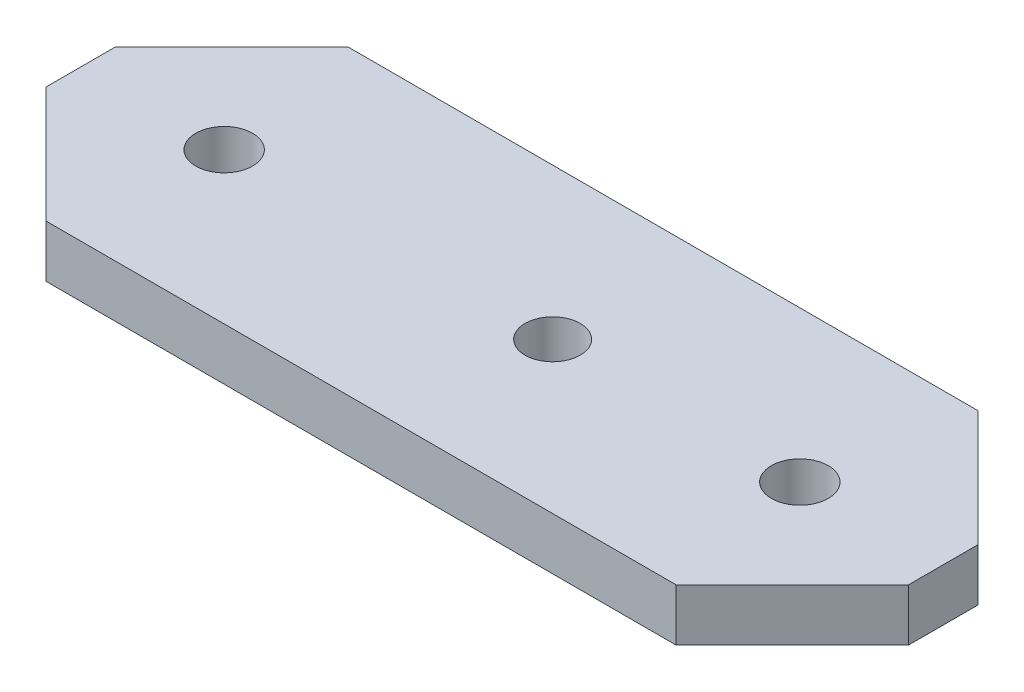
ISO-10303-21;
HEADER;
FILE_DESCRIPTION(('STEP AP214'),'2;1');
FILE_NAME('part.step','',(''),(''),'','','');
FILE_SCHEMA(('AUTOMOTIVE_DESIGN { 1 0 10303 214 1 1 1 1 }'));
ENDSEC;
DATA;
#1=APPLICATION_CONTEXT('core data for automotive mechanical design processes');
#2=APPLICATION_PROTOCOL_DEFINITION('international standard','automotive_design',2000,#1);
#3=PRODUCT_CONTEXT('',#1,'mechanical');
#4=PRODUCT('Part','Part','',(#3));
#5=PRODUCT_RELATED_PRODUCT_CATEGORY('part','',(#4));
#6=PRODUCT_DEFINITION_FORMATION('','',#4);
#7=PRODUCT_DEFINITION_CONTEXT('part definition',#1,'design');
#8=PRODUCT_DEFINITION('design','',#6,#7);
#9=PRODUCT_DEFINITION_SHAPE('','',#8);
#10=(LENGTH_UNIT() NAMED_UNIT(*) SI_UNIT(.MILLI.,.METRE.));
#11=(NAMED_UNIT(*) PLANE_ANGLE_UNIT() SI_UNIT($,.RADIAN.));
#12=(NAMED_UNIT(*) SI_UNIT($,.STERADIAN.) SOLID_ANGLE_UNIT());
#13=UNCERTAINTY_MEASURE_WITH_UNIT(LENGTH_MEASURE(1.E-05),#10,'distance_accuracy_value','');
#14=(GEOMETRIC_REPRESENTATION_CONTEXT(3) GLOBAL_UNCERTAINTY_ASSIGNED_CONTEXT((#13)) GLOBAL_UNIT_ASSIGNED_CONTEXT((#10,
#11,#12)) REPRESENTATION_CONTEXT('',''));
#15=CARTESIAN_POINT('',(0.,0.,0.));
#16=DIRECTION('',(0.,0.,1.));
#17=DIRECTION('',(1.,0.,0.));
#18=AXIS2_PLACEMENT_3D('',#15,#16,#17);
#19=CARTESIAN_POINT('',(40.15,4.5,-13.));
#20=DIRECTION('',(0.,-1.,0.));
#21=DIRECTION('',(0.,0.,-1.));
#22=AXIS2_PLACEMENT_3D('',#19,#20,#21);
#23=PLANE('',#22);
#24=CARTESIAN_POINT('',(3.5,4.5,-13.));
#25=DIRECTION('',(0.,1.,0.));
#26=DIRECTION('',(0.,0.,1.));
#27=AXIS2_PLACEMENT_3D('',#24,#25,#26);
#28=CIRCLE('',#27,2.375);
#29=CARTESIAN_POINT('',(3.5,4.5,-10.625));
#30=VERTEX_POINT('',#29);
#31=EDGE_CURVE('E206',#30,#30,#28,.T.);
#32=ORIENTED_EDGE('',*,*,#31,.F.);
#33=EDGE_LOOP('',(#32));
#34=FACE_BOUND('',#33,.T.);
#35=CARTESIAN_POINT('',(24.8,4.5,-13.));
#36=DIRECTION('',(0.,1.,0.));
#37=DIRECTION('',(0.,0.,1.));
#38=AXIS2_PLACEMENT_3D('',#35,#36,#37);
#39=CIRCLE('',#38,2.45000000000001);
#40=CARTESIAN_POINT('',(24.8,4.5,-10.55));
#41=VERTEX_POINT('',#40);
#42=EDGE_CURVE('E149',#41,#41,#39,.T.);
#43=ORIENTED_EDGE('',*,*,#42,.F.);
#44=EDGE_LOOP('',(#43));
#45=FACE_BOUND('',#44,.T.);
#46=DIRECTION('',(0.707106781186548,0.,-0.707106781186547));
#47=VECTOR('',#46,1.);
#48=CARTESIAN_POINT('',(27.15,4.5,0.));
#49=LINE('',#48,#47);
#50=CARTESIAN_POINT('',(27.15,4.5,0.));
#51=VERTEX_POINT('',#50);
#52=CARTESIAN_POINT('',(37.15,4.5,-10.));
#53=VERTEX_POINT('',#52);
#54=EDGE_CURVE('E160',#51,#53,#49,.T.);
#55=ORIENTED_EDGE('',*,*,#54,.T.);
#56=DIRECTION('',(0.,0.,-1.));
#57=VECTOR('',#56,1.);
#58=CARTESIAN_POINT('',(37.15,4.5,-10.));
#59=LINE('',#58,#57);
#60=CARTESIAN_POINT('',(37.15,4.5,-16.));
#61=VERTEX_POINT('',#60);
#62=EDGE_CURVE('E108',#53,#61,#59,.T.);
#63=ORIENTED_EDGE('',*,*,#62,.T.);
#64=DIRECTION('',(-0.707106781186548,0.,-0.707106781186548));
#65=VECTOR('',#64,1.);
#66=CARTESIAN_POINT('',(27.15,4.5,-26.));
#67=LINE('',#66,#65);
#68=CARTESIAN_POINT('',(27.15,4.5,-26.));
#69=VERTEX_POINT('',#68);
#70=EDGE_CURVE('E175',#61,#69,#67,.T.);
#71=ORIENTED_EDGE('',*,*,#70,.T.);
#72=DIRECTION('',(-1.,0.,0.));
#73=VECTOR('',#72,1.);
#74=CARTESIAN_POINT('',(-27.15,4.5,-26.));
#75=LINE('',#74,#73);
#76=CARTESIAN_POINT('',(-27.15,4.5,-26.));
#77=VERTEX_POINT('',#76);
#78=EDGE_CURVE('E188',#69,#77,#75,.T.);
#79=ORIENTED_EDGE('',*,*,#78,.T.);
#80=DIRECTION('',(-0.707106781186548,0.,0.707106781186547));
#81=VECTOR('',#80,1.);
#82=CARTESIAN_POINT('',(-27.15,4.5,-26.));
#83=LINE('',#82,#81);
#84=CARTESIAN_POINT('',(-37.15,4.5,-16.));
#85=VERTEX_POINT('',#84);
#86=EDGE_CURVE('E127',#77,#85,#83,.T.);
#87=ORIENTED_EDGE('',*,*,#86,.T.);
#88=DIRECTION('',(0.,0.,1.));
#89=VECTOR('',#88,1.);
#90=CARTESIAN_POINT('',(-37.15,4.5,-10.));
#91=LINE('',#90,#89);
#92=CARTESIAN_POINT('',(-37.15,4.5,-10.));
#93=VERTEX_POINT('',#92);
#94=EDGE_CURVE('E121',#85,#93,#91,.T.);
#95=ORIENTED_EDGE('',*,*,#94,.T.);
#96=DIRECTION('',(0.707106781186548,0.,0.707106781186547));
#97=VECTOR('',#96,1.);
#98=CARTESIAN_POINT('',(-27.15,4.5,0.));
#99=LINE('',#98,#97);
#100=CARTESIAN_POINT('',(-27.15,4.5,0.));
#101=VERTEX_POINT('',#100);
#102=EDGE_CURVE('E125',#93,#101,#99,.T.);
#103=ORIENTED_EDGE('',*,*,#102,.T.);
#104=DIRECTION('',(1.,0.,0.));
#105=VECTOR('',#104,1.);
#106=CARTESIAN_POINT('',(-27.15,4.5,0.));
#107=LINE('',#106,#105);
#108=EDGE_CURVE('E65',#101,#51,#107,.T.);
#109=ORIENTED_EDGE('',*,*,#108,.T.);
#110=EDGE_LOOP('',(#55,#63,#71,#79,#87,#95,#103,#109));
#111=FACE_BOUND('',#110,.T.);
#112=CARTESIAN_POINT('',(-24.8,4.5,-13.));
#113=DIRECTION('',(0.,1.,0.));
#114=DIRECTION('',(0.,0.,-1.));
#115=AXIS2_PLACEMENT_3D('',#112,#113,#114);
#116=CIRCLE('',#115,2.45000000000001);
#117=CARTESIAN_POINT('',(-24.8,4.5,-15.45));
#118=VERTEX_POINT('',#117);
#119=EDGE_CURVE('E197',#118,#118,#116,.T.);
#120=ORIENTED_EDGE('',*,*,#119,.F.);
#121=EDGE_LOOP('',(#120));
#122=FACE_BOUND('',#121,.T.);
#123=ADVANCED_FACE('F48',(#34,#45,#111,#122),#23,.F.);
#124=CARTESIAN_POINT('',(40.15,0.,-13.));
#125=DIRECTION('',(0.,-1.,0.));
#126=DIRECTION('',(0.,0.,-1.));
#127=AXIS2_PLACEMENT_3D('',#124,#125,#126);
#128=PLANE('',#127);
#129=CARTESIAN_POINT('',(3.5,0.,-13.));
#130=DIRECTION('',(0.,1.,0.));
#131=DIRECTION('',(0.,0.,1.));
#132=AXIS2_PLACEMENT_3D('',#129,#130,#131);
#133=CIRCLE('',#132,2.375);
#134=CARTESIAN_POINT('',(3.5,0.,-10.625));
#135=VERTEX_POINT('',#134);
#136=EDGE_CURVE('E203',#135,#135,#133,.T.);
#137=ORIENTED_EDGE('',*,*,#136,.T.);
#138=EDGE_LOOP('',(#137));
#139=FACE_BOUND('',#138,.T.);
#140=CARTESIAN_POINT('',(24.8,0.,-13.));
#141=DIRECTION('',(0.,1.,0.));
#142=DIRECTION('',(0.,0.,1.));
#143=AXIS2_PLACEMENT_3D('',#140,#141,#142);
#144=CIRCLE('',#143,2.45000000000001);
#145=CARTESIAN_POINT('',(24.8,0.,-10.55));
#146=VERTEX_POINT('',#145);
#147=EDGE_CURVE('E194',#146,#146,#144,.T.);
#148=ORIENTED_EDGE('',*,*,#147,.T.);
#149=EDGE_LOOP('',(#148));
#150=FACE_BOUND('',#149,.T.);
#151=DIRECTION('',(0.707106781186548,0.,-0.707106781186547));
#152=VECTOR('',#151,1.);
#153=CARTESIAN_POINT('',(27.15,0.,0.));
#154=LINE('',#153,#152);
#155=CARTESIAN_POINT('',(27.15,0.,0.));
#156=VERTEX_POINT('',#155);
#157=CARTESIAN_POINT('',(37.15,0.,-10.));
#158=VERTEX_POINT('',#157);
#159=EDGE_CURVE('E145',#156,#158,#154,.T.);
#160=ORIENTED_EDGE('',*,*,#159,.F.);
#161=DIRECTION('',(1.,0.,0.));
#162=VECTOR('',#161,1.);
#163=CARTESIAN_POINT('',(-27.15,0.,0.));
#164=LINE('',#163,#162);
#165=CARTESIAN_POINT('',(-27.15,0.,0.));
#166=VERTEX_POINT('',#165);
#167=EDGE_CURVE('E100',#166,#156,#164,.T.);
#168=ORIENTED_EDGE('',*,*,#167,.F.);
#169=DIRECTION('',(0.707106781186548,0.,0.707106781186547));
#170=VECTOR('',#169,1.);
#171=CARTESIAN_POINT('',(-27.15,0.,0.));
#172=LINE('',#171,#170);
#173=CARTESIAN_POINT('',(-37.15,0.,-10.));
#174=VERTEX_POINT('',#173);
#175=EDGE_CURVE('E94',#174,#166,#172,.T.);
#176=ORIENTED_EDGE('',*,*,#175,.F.);
#177=DIRECTION('',(0.,0.,1.));
#178=VECTOR('',#177,1.);
#179=CARTESIAN_POINT('',(-37.15,0.,-10.));
#180=LINE('',#179,#178);
#181=CARTESIAN_POINT('',(-37.15,0.,-16.));
#182=VERTEX_POINT('',#181);
#183=EDGE_CURVE('E135',#182,#174,#180,.T.);
#184=ORIENTED_EDGE('',*,*,#183,.F.);
#185=DIRECTION('',(-0.707106781186548,0.,0.707106781186547));
#186=VECTOR('',#185,1.);
#187=CARTESIAN_POINT('',(-27.15,0.,-26.));
#188=LINE('',#187,#186);
#189=CARTESIAN_POINT('',(-27.15,0.,-26.));
#190=VERTEX_POINT('',#189);
#191=EDGE_CURVE('E155',#190,#182,#188,.T.);
#192=ORIENTED_EDGE('',*,*,#191,.F.);
#193=DIRECTION('',(-1.,0.,0.));
#194=VECTOR('',#193,1.);
#195=CARTESIAN_POINT('',(-27.15,0.,-26.));
#196=LINE('',#195,#194);
#197=CARTESIAN_POINT('',(27.15,0.,-26.));
#198=VERTEX_POINT('',#197);
#199=EDGE_CURVE('E153',#198,#190,#196,.T.);
#200=ORIENTED_EDGE('',*,*,#199,.F.);
#201=DIRECTION('',(-0.707106781186548,0.,-0.707106781186548));
#202=VECTOR('',#201,1.);
#203=CARTESIAN_POINT('',(27.15,0.,-26.));
#204=LINE('',#203,#202);
#205=CARTESIAN_POINT('',(37.15,0.,-16.));
#206=VERTEX_POINT('',#205);
#207=EDGE_CURVE('E151',#206,#198,#204,.T.);
#208=ORIENTED_EDGE('',*,*,#207,.F.);
#209=DIRECTION('',(0.,0.,-1.));
#210=VECTOR('',#209,1.);
#211=CARTESIAN_POINT('',(37.15,0.,-10.));
#212=LINE('',#211,#210);
#213=EDGE_CURVE('E148',#158,#206,#212,.T.);
#214=ORIENTED_EDGE('',*,*,#213,.F.);
#215=EDGE_LOOP('',(#160,#168,#176,#184,#192,#200,#208,#214));
#216=FACE_BOUND('',#215,.T.);
#217=CARTESIAN_POINT('',(-24.8,0.,-13.));
#218=DIRECTION('',(0.,1.,0.));
#219=DIRECTION('',(0.,0.,-1.));
#220=AXIS2_PLACEMENT_3D('',#217,#218,#219);
#221=CIRCLE('',#220,2.45000000000001);
#222=CARTESIAN_POINT('',(-24.8,0.,-15.45));
#223=VERTEX_POINT('',#222);
#224=EDGE_CURVE('E200',#223,#223,#221,.T.);
#225=ORIENTED_EDGE('',*,*,#224,.T.);
#226=EDGE_LOOP('',(#225));
#227=FACE_BOUND('',#226,.T.);
#228=ADVANCED_FACE('F179',(#139,#150,#216,#227),#128,.T.);
#229=CARTESIAN_POINT('',(27.15,4.5,0.));
#230=DIRECTION('',(-0.707106781186547,0.,-0.707106781186548));
#231=DIRECTION('',(-0.707106781186548,0.,0.707106781186547));
#232=AXIS2_PLACEMENT_3D('',#229,#230,#231);
#233=PLANE('',#232);
#234=ORIENTED_EDGE('',*,*,#159,.T.);
#235=DIRECTION('',(0.,-1.,0.));
#236=VECTOR('',#235,1.);
#237=CARTESIAN_POINT('',(37.15,4.5,-10.));
#238=LINE('',#237,#236);
#239=EDGE_CURVE('E13',#53,#158,#238,.T.);
#240=ORIENTED_EDGE('',*,*,#239,.F.);
#241=ORIENTED_EDGE('',*,*,#54,.F.);
#242=DIRECTION('',(0.,-1.,0.));
#243=VECTOR('',#242,1.);
#244=CARTESIAN_POINT('',(27.15,4.5,0.));
#245=LINE('',#244,#243);
#246=EDGE_CURVE('E141',#51,#156,#245,.T.);
#247=ORIENTED_EDGE('',*,*,#246,.T.);
#248=EDGE_LOOP('',(#234,#240,#241,#247));
#249=FACE_BOUND('',#248,.T.);
#250=ADVANCED_FACE('F50',(#249),#233,.F.);
#251=CARTESIAN_POINT('',(37.15,4.5,-10.));
#252=DIRECTION('',(-1.,0.,0.));
#253=DIRECTION('',(0.,0.,1.));
#254=AXIS2_PLACEMENT_3D('',#251,#252,#253);
#255=PLANE('',#254);
#256=ORIENTED_EDGE('',*,*,#213,.T.);
#257=DIRECTION('',(0.,-1.,0.));
#258=VECTOR('',#257,1.);
#259=CARTESIAN_POINT('',(37.15,4.5,-16.));
#260=LINE('',#259,#258);
#261=EDGE_CURVE('E57',#61,#206,#260,.T.);
#262=ORIENTED_EDGE('',*,*,#261,.F.);
#263=ORIENTED_EDGE('',*,*,#62,.F.);
#264=ORIENTED_EDGE('',*,*,#239,.T.);
#265=EDGE_LOOP('',(#256,#262,#263,#264));
#266=FACE_BOUND('',#265,.T.);
#267=ADVANCED_FACE('F237',(#266),#255,.F.);
#268=CARTESIAN_POINT('',(27.15,4.5,-26.));
#269=DIRECTION('',(-0.707106781186547,0.,0.707106781186547));
#270=DIRECTION('',(0.707106781186548,0.,0.707106781186548));
#271=AXIS2_PLACEMENT_3D('',#268,#269,#270);
#272=PLANE('',#271);
#273=ORIENTED_EDGE('',*,*,#207,.T.);
#274=DIRECTION('',(0.,-1.,0.));
#275=VECTOR('',#274,1.);
#276=CARTESIAN_POINT('',(27.15,4.5,-26.));
#277=LINE('',#276,#275);
#278=EDGE_CURVE('E167',#69,#198,#277,.T.);
#279=ORIENTED_EDGE('',*,*,#278,.F.);
#280=ORIENTED_EDGE('',*,*,#70,.F.);
#281=ORIENTED_EDGE('',*,*,#261,.T.);
#282=EDGE_LOOP('',(#273,#279,#280,#281));
#283=FACE_BOUND('',#282,.T.);
#284=ADVANCED_FACE('F173',(#283),#272,.F.);
#285=CARTESIAN_POINT('',(-27.15,4.5,-26.));
#286=DIRECTION('',(0.,0.,1.));
#287=DIRECTION('',(1.,0.,0.));
#288=AXIS2_PLACEMENT_3D('',#285,#286,#287);
#289=PLANE('',#288);
#290=ORIENTED_EDGE('',*,*,#199,.T.);
#291=DIRECTION('',(0.,-1.,0.));
#292=VECTOR('',#291,1.);
#293=CARTESIAN_POINT('',(-27.15,4.5,-26.));
#294=LINE('',#293,#292);
#295=EDGE_CURVE('E164',#77,#190,#294,.T.);
#296=ORIENTED_EDGE('',*,*,#295,.F.);
#297=ORIENTED_EDGE('',*,*,#78,.F.);
#298=ORIENTED_EDGE('',*,*,#278,.T.);
#299=EDGE_LOOP('',(#290,#296,#297,#298));
#300=FACE_BOUND('',#299,.T.);
#301=ADVANCED_FACE('F184',(#300),#289,.F.);
#302=CARTESIAN_POINT('',(-27.15,4.5,-26.));
#303=DIRECTION('',(0.707106781186547,0.,0.707106781186548));
#304=DIRECTION('',(0.707106781186548,0.,-0.707106781186547));
#305=AXIS2_PLACEMENT_3D('',#302,#303,#304);
#306=PLANE('',#305);
#307=ORIENTED_EDGE('',*,*,#191,.T.);
#308=DIRECTION('',(0.,-1.,0.));
#309=VECTOR('',#308,1.);
#310=CARTESIAN_POINT('',(-37.15,4.5,-16.));
#311=LINE('',#310,#309);
#312=EDGE_CURVE('E136',#85,#182,#311,.T.);
#313=ORIENTED_EDGE('',*,*,#312,.F.);
#314=ORIENTED_EDGE('',*,*,#86,.F.);
#315=ORIENTED_EDGE('',*,*,#295,.T.);
#316=EDGE_LOOP('',(#307,#313,#314,#315));
#317=FACE_BOUND('',#316,.T.);
#318=ADVANCED_FACE('F187',(#317),#306,.F.);
#319=CARTESIAN_POINT('',(-37.15,4.5,-10.));
#320=DIRECTION('',(1.,0.,0.));
#321=DIRECTION('',(0.,0.,-1.));
#322=AXIS2_PLACEMENT_3D('',#319,#320,#321);
#323=PLANE('',#322);
#324=ORIENTED_EDGE('',*,*,#183,.T.);
#325=DIRECTION('',(0.,-1.,0.));
#326=VECTOR('',#325,1.);
#327=CARTESIAN_POINT('',(-37.15,4.5,-10.));
#328=LINE('',#327,#326);
#329=EDGE_CURVE('E132',#93,#174,#328,.T.);
#330=ORIENTED_EDGE('',*,*,#329,.F.);
#331=ORIENTED_EDGE('',*,*,#94,.F.);
#332=ORIENTED_EDGE('',*,*,#312,.T.);
#333=EDGE_LOOP('',(#324,#330,#331,#332));
#334=FACE_BOUND('',#333,.T.);
#335=ADVANCED_FACE('F133',(#334),#323,.F.);
#336=CARTESIAN_POINT('',(-27.15,4.5,0.));
#337=DIRECTION('',(0.707106781186547,0.,-0.707106781186548));
#338=DIRECTION('',(-0.707106781186548,0.,-0.707106781186547));
#339=AXIS2_PLACEMENT_3D('',#336,#337,#338);
#340=PLANE('',#339);
#341=ORIENTED_EDGE('',*,*,#175,.T.);
#342=DIRECTION('',(0.,-1.,0.));
#343=VECTOR('',#342,1.);
#344=CARTESIAN_POINT('',(-27.15,4.5,0.));
#345=LINE('',#344,#343);
#346=EDGE_CURVE('E137',#101,#166,#345,.T.);
#347=ORIENTED_EDGE('',*,*,#346,.F.);
#348=ORIENTED_EDGE('',*,*,#102,.F.);
#349=ORIENTED_EDGE('',*,*,#329,.T.);
#350=EDGE_LOOP('',(#341,#347,#348,#349));
#351=FACE_BOUND('',#350,.T.);
#352=ADVANCED_FACE('F139',(#351),#340,.F.);
#353=CARTESIAN_POINT('',(-27.15,4.5,0.));
#354=DIRECTION('',(0.,0.,-1.));
#355=DIRECTION('',(-1.,0.,0.));
#356=AXIS2_PLACEMENT_3D('',#353,#354,#355);
#357=PLANE('',#356);
#358=ORIENTED_EDGE('',*,*,#167,.T.);
#359=ORIENTED_EDGE('',*,*,#246,.F.);
#360=ORIENTED_EDGE('',*,*,#108,.F.);
#361=ORIENTED_EDGE('',*,*,#346,.T.);
#362=EDGE_LOOP('',(#358,#359,#360,#361));
#363=FACE_BOUND('',#362,.T.);
#364=ADVANCED_FACE('F229',(#363),#357,.F.);
#365=CARTESIAN_POINT('',(24.8,4.5,-13.));
#366=DIRECTION('',(0.,-1.,0.));
#367=DIRECTION('',(0.,0.,-1.));
#368=AXIS2_PLACEMENT_3D('',#365,#366,#367);
#369=CYLINDRICAL_SURFACE('',#368,2.45000000000001);
#370=ORIENTED_EDGE('',*,*,#42,.T.);
#371=EDGE_LOOP('',(#370));
#372=FACE_BOUND('',#371,.T.);
#373=ORIENTED_EDGE('',*,*,#147,.F.);
#374=EDGE_LOOP('',(#373));
#375=FACE_BOUND('',#374,.T.);
#376=ADVANCED_FACE('F226',(#372,#375),#369,.F.);
#377=CARTESIAN_POINT('',(-24.8,4.5,-13.));
#378=DIRECTION('',(0.,-1.,0.));
#379=DIRECTION('',(0.,0.,-1.));
#380=AXIS2_PLACEMENT_3D('',#377,#378,#379);
#381=CYLINDRICAL_SURFACE('',#380,2.45000000000001);
#382=ORIENTED_EDGE('',*,*,#119,.T.);
#383=EDGE_LOOP('',(#382));
#384=FACE_BOUND('',#383,.T.);
#385=ORIENTED_EDGE('',*,*,#224,.F.);
#386=EDGE_LOOP('',(#385));
#387=FACE_BOUND('',#386,.T.);
#388=ADVANCED_FACE('F217',(#384,#387),#381,.F.);
#389=CARTESIAN_POINT('',(3.5,0.,-13.));
#390=DIRECTION('',(0.,1.,0.));
#391=DIRECTION('',(0.,0.,1.));
#392=AXIS2_PLACEMENT_3D('',#389,#390,#391);
#393=CYLINDRICAL_SURFACE('',#392,2.375);
#394=ORIENTED_EDGE('',*,*,#136,.F.);
#395=EDGE_LOOP('',(#394));
#396=FACE_BOUND('',#395,.T.);
#397=ORIENTED_EDGE('',*,*,#31,.T.);
#398=EDGE_LOOP('',(#397));
#399=FACE_BOUND('',#398,.T.);
#400=ADVANCED_FACE('F214',(#396,#399),#393,.F.);
#401=CLOSED_SHELL('',(#123,#228,#250,#267,#284,#301,#318,#335,#352,#364,#376,#388,#400));
#402=MANIFOLD_SOLID_BREP('B2',#401);
#403=ADVANCED_BREP_SHAPE_REPRESENTATION('',(#18,#402),#14);
#404=SHAPE_DEFINITION_REPRESENTATION(#9,#403);
ENDSEC;
END-ISO-10303-21;
